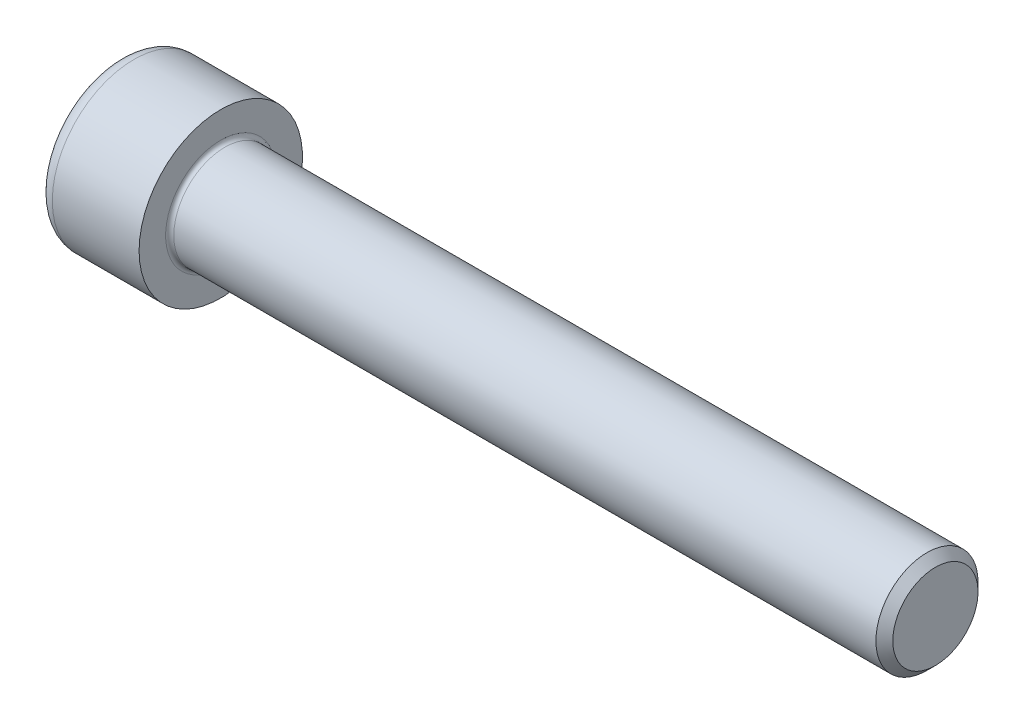
ISO-10303-21;
HEADER;
FILE_DESCRIPTION(('STEP AP214'),'2;1');
FILE_NAME('part.step','',(''),(''),'','','');
FILE_SCHEMA(('AUTOMOTIVE_DESIGN { 1 0 10303 214 1 1 1 1 }'));
ENDSEC;
DATA;
#1=APPLICATION_CONTEXT('core data for automotive mechanical design processes');
#2=APPLICATION_PROTOCOL_DEFINITION('international standard','automotive_design',2000,#1);
#3=PRODUCT_CONTEXT('',#1,'mechanical');
#4=PRODUCT('Part','Part','',(#3));
#5=PRODUCT_RELATED_PRODUCT_CATEGORY('part','',(#4));
#6=PRODUCT_DEFINITION_FORMATION('','',#4);
#7=PRODUCT_DEFINITION_CONTEXT('part definition',#1,'design');
#8=PRODUCT_DEFINITION('design','',#6,#7);
#9=PRODUCT_DEFINITION_SHAPE('','',#8);
#10=(LENGTH_UNIT() NAMED_UNIT(*) SI_UNIT(.MILLI.,.METRE.));
#11=(NAMED_UNIT(*) PLANE_ANGLE_UNIT() SI_UNIT($,.RADIAN.));
#12=(NAMED_UNIT(*) SI_UNIT($,.STERADIAN.) SOLID_ANGLE_UNIT());
#13=UNCERTAINTY_MEASURE_WITH_UNIT(LENGTH_MEASURE(1.E-05),#10,'distance_accuracy_value','');
#14=(GEOMETRIC_REPRESENTATION_CONTEXT(3) GLOBAL_UNCERTAINTY_ASSIGNED_CONTEXT((#13)) GLOBAL_UNIT_ASSIGNED_CONTEXT((#10,
#11,#12)) REPRESENTATION_CONTEXT('',''));
#15=CARTESIAN_POINT('',(0.,0.,0.));
#16=DIRECTION('',(0.,0.,1.));
#17=DIRECTION('',(1.,0.,0.));
#18=AXIS2_PLACEMENT_3D('',#15,#16,#17);
#19=CARTESIAN_POINT('',(0.,0.,0.));
#20=DIRECTION('',(-1.,0.,0.));
#21=DIRECTION('',(0.,0.,1.));
#22=AXIS2_PLACEMENT_3D('',#19,#20,#21);
#23=PLANE('',#22);
#24=DIRECTION('',(0.,-0.499999999999999,0.866025403784439));
#25=VECTOR('',#24,1.);
#26=CARTESIAN_POINT('',(0.,4.68519743447381,0.));
#27=LINE('',#26,#25);
#28=CARTESIAN_POINT('',(0.,4.68519743447381,0.));
#29=VERTEX_POINT('',#28);
#30=CARTESIAN_POINT('',(0.,2.34259871723691,4.05749999999999));
#31=VERTEX_POINT('',#30);
#32=EDGE_CURVE('E115',#29,#31,#27,.T.);
#33=ORIENTED_EDGE('',*,*,#32,.T.);
#34=DIRECTION('',(0.,1.,0.));
#35=VECTOR('',#34,1.);
#36=CARTESIAN_POINT('',(0.,-2.3425987172369,4.0575));
#37=LINE('',#36,#35);
#38=CARTESIAN_POINT('',(0.,-2.3425987172369,4.0575));
#39=VERTEX_POINT('',#38);
#40=EDGE_CURVE('E104',#39,#31,#37,.T.);
#41=ORIENTED_EDGE('',*,*,#40,.F.);
#42=DIRECTION('',(0.,-0.500000000000001,-0.866025403784438));
#43=VECTOR('',#42,1.);
#44=CARTESIAN_POINT('',(0.,-2.3425987172369,4.0575));
#45=LINE('',#44,#43);
#46=CARTESIAN_POINT('',(0.,-4.68519743447382,0.));
#47=VERTEX_POINT('',#46);
#48=EDGE_CURVE('E114',#39,#47,#45,.T.);
#49=ORIENTED_EDGE('',*,*,#48,.T.);
#50=DIRECTION('',(0.,0.499999999999999,-0.866025403784439));
#51=VECTOR('',#50,1.);
#52=CARTESIAN_POINT('',(0.,-4.68519743447382,0.));
#53=LINE('',#52,#51);
#54=CARTESIAN_POINT('',(0.,-2.34259871723692,-4.0575));
#55=VERTEX_POINT('',#54);
#56=EDGE_CURVE('E133',#47,#55,#53,.T.);
#57=ORIENTED_EDGE('',*,*,#56,.T.);
#58=DIRECTION('',(0.,-1.,0.));
#59=VECTOR('',#58,1.);
#60=CARTESIAN_POINT('',(0.,2.3425987172369,-4.05750000000001));
#61=LINE('',#60,#59);
#62=CARTESIAN_POINT('',(0.,2.3425987172369,-4.05750000000001));
#63=VERTEX_POINT('',#62);
#64=EDGE_CURVE('E136',#63,#55,#61,.T.);
#65=ORIENTED_EDGE('',*,*,#64,.F.);
#66=DIRECTION('',(0.,-0.500000000000001,-0.866025403784438));
#67=VECTOR('',#66,1.);
#68=CARTESIAN_POINT('',(0.,4.68519743447381,0.));
#69=LINE('',#68,#67);
#70=EDGE_CURVE('E129',#29,#63,#69,.T.);
#71=ORIENTED_EDGE('',*,*,#70,.F.);
#72=EDGE_LOOP('',(#33,#41,#49,#57,#65,#71));
#73=FACE_BOUND('',#72,.T.);
#74=CARTESIAN_POINT('',(0.,0.,0.));
#75=DIRECTION('',(-1.,0.,0.));
#76=DIRECTION('',(0.,0.,1.));
#77=AXIS2_PLACEMENT_3D('',#74,#75,#76);
#78=CIRCLE('',#77,6.5);
#79=CARTESIAN_POINT('',(0.,0.,6.5));
#80=VERTEX_POINT('',#79);
#81=EDGE_CURVE('E40',#80,#80,#78,.T.);
#82=ORIENTED_EDGE('',*,*,#81,.T.);
#83=EDGE_LOOP('',(#82));
#84=FACE_BOUND('',#83,.T.);
#85=ADVANCED_FACE('F33',(#73,#84),#23,.T.);
#86=CARTESIAN_POINT('',(-31.75,0.,0.));
#87=DIRECTION('',(-1.,0.,0.));
#88=DIRECTION('',(0.,0.,1.));
#89=AXIS2_PLACEMENT_3D('',#86,#87,#88);
#90=CYLINDRICAL_SURFACE('',#89,8.);
#91=CARTESIAN_POINT('',(1.5,0.,0.));
#92=DIRECTION('',(-1.,0.,0.));
#93=DIRECTION('',(0.,0.,1.));
#94=AXIS2_PLACEMENT_3D('',#91,#92,#93);
#95=CIRCLE('',#94,8.);
#96=CARTESIAN_POINT('',(1.5,0.,8.));
#97=VERTEX_POINT('',#96);
#98=EDGE_CURVE('E11',#97,#97,#95,.F.);
#99=ORIENTED_EDGE('',*,*,#98,.T.);
#100=EDGE_LOOP('',(#99));
#101=FACE_BOUND('',#100,.T.);
#102=CARTESIAN_POINT('',(10.,0.,0.));
#103=DIRECTION('',(-1.,0.,0.));
#104=DIRECTION('',(0.,0.,1.));
#105=AXIS2_PLACEMENT_3D('',#102,#103,#104);
#106=CIRCLE('',#105,8.);
#107=CARTESIAN_POINT('',(10.,0.,8.));
#108=VERTEX_POINT('',#107);
#109=EDGE_CURVE('E181',#108,#108,#106,.T.);
#110=ORIENTED_EDGE('',*,*,#109,.T.);
#111=EDGE_LOOP('',(#110));
#112=FACE_BOUND('',#111,.T.);
#113=ADVANCED_FACE('F208',(#101,#112),#90,.T.);
#114=CARTESIAN_POINT('',(10.,8.,0.));
#115=DIRECTION('',(1.,0.,0.));
#116=DIRECTION('',(0.,0.,-1.));
#117=AXIS2_PLACEMENT_3D('',#114,#115,#116);
#118=PLANE('',#117);
#119=CARTESIAN_POINT('',(10.,0.,0.));
#120=DIRECTION('',(1.,0.,0.));
#121=DIRECTION('',(0.,0.,-1.));
#122=AXIS2_PLACEMENT_3D('',#119,#120,#121);
#123=CIRCLE('',#122,5.39999999999998);
#124=CARTESIAN_POINT('',(10.,0.,-5.39999999999998));
#125=VERTEX_POINT('',#124);
#126=EDGE_CURVE('E184',#125,#125,#123,.F.);
#127=ORIENTED_EDGE('',*,*,#126,.T.);
#128=EDGE_LOOP('',(#127));
#129=FACE_BOUND('',#128,.T.);
#130=ORIENTED_EDGE('',*,*,#109,.F.);
#131=EDGE_LOOP('',(#130));
#132=FACE_BOUND('',#131,.T.);
#133=ADVANCED_FACE('F212',(#129,#132),#118,.T.);
#134=CARTESIAN_POINT('',(-31.75,0.,0.));
#135=DIRECTION('',(-1.,0.,0.));
#136=DIRECTION('',(0.,0.,1.));
#137=AXIS2_PLACEMENT_3D('',#134,#135,#136);
#138=CYLINDRICAL_SURFACE('',#137,4.99999999999998);
#139=CARTESIAN_POINT('',(10.4,0.,0.));
#140=DIRECTION('',(1.,0.,0.));
#141=DIRECTION('',(0.,0.,-1.));
#142=AXIS2_PLACEMENT_3D('',#139,#140,#141);
#143=CIRCLE('',#142,4.99999999999998);
#144=CARTESIAN_POINT('',(10.4,0.,-4.99999999999998));
#145=VERTEX_POINT('',#144);
#146=EDGE_CURVE('E187',#145,#145,#143,.T.);
#147=ORIENTED_EDGE('',*,*,#146,.T.);
#148=EDGE_LOOP('',(#147));
#149=FACE_BOUND('',#148,.T.);
#150=CARTESIAN_POINT('',(79.172,0.,0.));
#151=DIRECTION('',(-1.,0.,0.));
#152=DIRECTION('',(0.,0.,1.));
#153=AXIS2_PLACEMENT_3D('',#150,#151,#152);
#154=CIRCLE('',#153,4.99999999999997);
#155=CARTESIAN_POINT('',(79.172,0.,4.99999999999997));
#156=VERTEX_POINT('',#155);
#157=EDGE_CURVE('E178',#156,#156,#154,.T.);
#158=ORIENTED_EDGE('',*,*,#157,.T.);
#159=EDGE_LOOP('',(#158));
#160=FACE_BOUND('',#159,.T.);
#161=ADVANCED_FACE('F217',(#149,#160),#138,.T.);
#162=CARTESIAN_POINT('',(80.,0.,0.));
#163=DIRECTION('',(-1.,0.,0.));
#164=DIRECTION('',(0.,0.,1.));
#165=AXIS2_PLACEMENT_3D('',#162,#163,#164);
#166=CONICAL_SURFACE('',#165,4.172,0.785398163397422);
#167=ORIENTED_EDGE('',*,*,#157,.F.);
#168=EDGE_LOOP('',(#167));
#169=FACE_BOUND('',#168,.T.);
#170=CARTESIAN_POINT('',(80.,0.,0.));
#171=DIRECTION('',(-1.,0.,0.));
#172=DIRECTION('',(0.,0.,1.));
#173=AXIS2_PLACEMENT_3D('',#170,#171,#172);
#174=CIRCLE('',#173,4.172);
#175=CARTESIAN_POINT('',(80.,0.,4.172));
#176=VERTEX_POINT('',#175);
#177=EDGE_CURVE('E174',#176,#176,#174,.T.);
#178=ORIENTED_EDGE('',*,*,#177,.T.);
#179=EDGE_LOOP('',(#178));
#180=FACE_BOUND('',#179,.T.);
#181=ADVANCED_FACE('F224',(#169,#180),#166,.T.);
#182=CARTESIAN_POINT('',(80.,4.172,0.));
#183=DIRECTION('',(1.,0.,0.));
#184=DIRECTION('',(0.,0.,-1.));
#185=AXIS2_PLACEMENT_3D('',#182,#183,#184);
#186=PLANE('',#185);
#187=ORIENTED_EDGE('',*,*,#177,.F.);
#188=EDGE_LOOP('',(#187));
#189=FACE_BOUND('',#188,.T.);
#190=ADVANCED_FACE('F202',(#189),#186,.T.);
#191=CARTESIAN_POINT('',(10.4,0.,0.));
#192=DIRECTION('',(1.,0.,0.));
#193=DIRECTION('',(0.,0.,-1.));
#194=AXIS2_PLACEMENT_3D('',#191,#192,#193);
#195=TOROIDAL_SURFACE('',#194,5.39999999999998,0.4);
#196=ORIENTED_EDGE('',*,*,#146,.F.);
#197=EDGE_LOOP('',(#196));
#198=FACE_BOUND('',#197,.T.);
#199=ORIENTED_EDGE('',*,*,#126,.F.);
#200=EDGE_LOOP('',(#199));
#201=FACE_BOUND('',#200,.T.);
#202=ADVANCED_FACE('F194',(#198,#201),#195,.F.);
#203=CARTESIAN_POINT('',(1.5,0.,0.));
#204=DIRECTION('',(-1.,0.,0.));
#205=DIRECTION('',(0.,0.,1.));
#206=AXIS2_PLACEMENT_3D('',#203,#204,#205);
#207=TOROIDAL_SURFACE('',#206,6.5,1.5);
#208=ORIENTED_EDGE('',*,*,#98,.F.);
#209=EDGE_LOOP('',(#208));
#210=FACE_BOUND('',#209,.T.);
#211=ORIENTED_EDGE('',*,*,#81,.F.);
#212=EDGE_LOOP('',(#211));
#213=FACE_BOUND('',#212,.T.);
#214=ADVANCED_FACE('F192',(#210,#213),#207,.T.);
#215=CARTESIAN_POINT('',(5.,4.68519743447381,0.));
#216=DIRECTION('',(0.,-0.866025403784439,-0.499999999999999));
#217=DIRECTION('',(0.,0.499999999999999,-0.866025403784439));
#218=AXIS2_PLACEMENT_3D('',#215,#216,#217);
#219=PLANE('',#218);
#220=ORIENTED_EDGE('',*,*,#32,.F.);
#221=DIRECTION('',(-1.,0.,0.));
#222=VECTOR('',#221,1.);
#223=CARTESIAN_POINT('',(5.,4.68519743447381,0.));
#224=LINE('',#223,#222);
#225=CARTESIAN_POINT('',(5.,4.68519743447381,0.));
#226=VERTEX_POINT('',#225);
#227=EDGE_CURVE('E159',#226,#29,#224,.T.);
#228=ORIENTED_EDGE('',*,*,#227,.F.);
#229=DIRECTION('',(0.,-0.499999999999999,0.866025403784439));
#230=VECTOR('',#229,1.);
#231=CARTESIAN_POINT('',(5.,4.68519743447381,0.));
#232=LINE('',#231,#230);
#233=CARTESIAN_POINT('',(5.,3.51389807585536,2.02874999999999));
#234=VERTEX_POINT('',#233);
#235=EDGE_CURVE('E139',#226,#234,#232,.T.);
#236=ORIENTED_EDGE('',*,*,#235,.T.);
#237=CARTESIAN_POINT('',(5.,2.34259871723691,4.05749999999999));
#238=VERTEX_POINT('',#237);
#239=EDGE_CURVE('E123',#234,#238,#232,.T.);
#240=ORIENTED_EDGE('',*,*,#239,.T.);
#241=DIRECTION('',(-1.,0.,0.));
#242=VECTOR('',#241,1.);
#243=CARTESIAN_POINT('',(5.,2.34259871723691,4.05749999999999));
#244=LINE('',#243,#242);
#245=EDGE_CURVE('E108',#238,#31,#244,.T.);
#246=ORIENTED_EDGE('',*,*,#245,.T.);
#247=EDGE_LOOP('',(#220,#228,#236,#240,#246));
#248=FACE_BOUND('',#247,.T.);
#249=ADVANCED_FACE('F119',(#248),#219,.T.);
#250=CARTESIAN_POINT('',(5.,-2.3425987172369,4.0575));
#251=DIRECTION('',(0.,0.,1.));
#252=DIRECTION('',(0.,-1.,0.));
#253=AXIS2_PLACEMENT_3D('',#250,#251,#252);
#254=PLANE('',#253);
#255=ORIENTED_EDGE('',*,*,#40,.T.);
#256=ORIENTED_EDGE('',*,*,#245,.F.);
#257=DIRECTION('',(0.,1.,0.));
#258=VECTOR('',#257,1.);
#259=CARTESIAN_POINT('',(5.,-2.3425987172369,4.0575));
#260=LINE('',#259,#258);
#261=CARTESIAN_POINT('',(5.,0.,4.0575));
#262=VERTEX_POINT('',#261);
#263=EDGE_CURVE('E141',#262,#238,#260,.T.);
#264=ORIENTED_EDGE('',*,*,#263,.F.);
#265=CARTESIAN_POINT('',(5.,-2.3425987172369,4.0575));
#266=VERTEX_POINT('',#265);
#267=EDGE_CURVE('E142',#266,#262,#260,.T.);
#268=ORIENTED_EDGE('',*,*,#267,.F.);
#269=DIRECTION('',(-1.,0.,0.));
#270=VECTOR('',#269,1.);
#271=CARTESIAN_POINT('',(5.,-2.3425987172369,4.0575));
#272=LINE('',#271,#270);
#273=EDGE_CURVE('E110',#266,#39,#272,.T.);
#274=ORIENTED_EDGE('',*,*,#273,.T.);
#275=EDGE_LOOP('',(#255,#256,#264,#268,#274));
#276=FACE_BOUND('',#275,.T.);
#277=ADVANCED_FACE('F106',(#276),#254,.F.);
#278=CARTESIAN_POINT('',(5.,-2.3425987172369,4.0575));
#279=DIRECTION('',(0.,0.866025403784438,-0.500000000000001));
#280=DIRECTION('',(0.,0.500000000000001,0.866025403784438));
#281=AXIS2_PLACEMENT_3D('',#278,#279,#280);
#282=PLANE('',#281);
#283=ORIENTED_EDGE('',*,*,#48,.F.);
#284=ORIENTED_EDGE('',*,*,#273,.F.);
#285=DIRECTION('',(0.,-0.500000000000001,-0.866025403784438));
#286=VECTOR('',#285,1.);
#287=CARTESIAN_POINT('',(5.,-2.3425987172369,4.0575));
#288=LINE('',#287,#286);
#289=CARTESIAN_POINT('',(5.,-3.51389807585536,2.02875));
#290=VERTEX_POINT('',#289);
#291=EDGE_CURVE('E146',#266,#290,#288,.T.);
#292=ORIENTED_EDGE('',*,*,#291,.T.);
#293=CARTESIAN_POINT('',(5.,-4.68519743447382,0.));
#294=VERTEX_POINT('',#293);
#295=EDGE_CURVE('E145',#290,#294,#288,.T.);
#296=ORIENTED_EDGE('',*,*,#295,.T.);
#297=DIRECTION('',(-1.,0.,0.));
#298=VECTOR('',#297,1.);
#299=CARTESIAN_POINT('',(5.,-4.68519743447382,0.));
#300=LINE('',#299,#298);
#301=EDGE_CURVE('E167',#294,#47,#300,.T.);
#302=ORIENTED_EDGE('',*,*,#301,.T.);
#303=EDGE_LOOP('',(#283,#284,#292,#296,#302));
#304=FACE_BOUND('',#303,.T.);
#305=ADVANCED_FACE('F274',(#304),#282,.T.);
#306=CARTESIAN_POINT('',(5.,-4.68519743447382,0.));
#307=DIRECTION('',(0.,0.866025403784439,0.499999999999999));
#308=DIRECTION('',(0.,-0.499999999999999,0.866025403784439));
#309=AXIS2_PLACEMENT_3D('',#306,#307,#308);
#310=PLANE('',#309);
#311=ORIENTED_EDGE('',*,*,#56,.F.);
#312=ORIENTED_EDGE('',*,*,#301,.F.);
#313=DIRECTION('',(0.,0.499999999999999,-0.866025403784439));
#314=VECTOR('',#313,1.);
#315=CARTESIAN_POINT('',(5.,-4.68519743447382,0.));
#316=LINE('',#315,#314);
#317=CARTESIAN_POINT('',(5.,-3.51389807585537,-2.02875));
#318=VERTEX_POINT('',#317);
#319=EDGE_CURVE('E150',#294,#318,#316,.T.);
#320=ORIENTED_EDGE('',*,*,#319,.T.);
#321=CARTESIAN_POINT('',(5.,-2.34259871723692,-4.0575));
#322=VERTEX_POINT('',#321);
#323=EDGE_CURVE('E149',#318,#322,#316,.T.);
#324=ORIENTED_EDGE('',*,*,#323,.T.);
#325=DIRECTION('',(-1.,0.,0.));
#326=VECTOR('',#325,1.);
#327=CARTESIAN_POINT('',(5.,-2.34259871723692,-4.0575));
#328=LINE('',#327,#326);
#329=EDGE_CURVE('E164',#322,#55,#328,.T.);
#330=ORIENTED_EDGE('',*,*,#329,.T.);
#331=EDGE_LOOP('',(#311,#312,#320,#324,#330));
#332=FACE_BOUND('',#331,.T.);
#333=ADVANCED_FACE('F283',(#332),#310,.T.);
#334=CARTESIAN_POINT('',(5.,2.3425987172369,-4.05750000000001));
#335=DIRECTION('',(0.,0.,-1.));
#336=DIRECTION('',(0.,1.,0.));
#337=AXIS2_PLACEMENT_3D('',#334,#335,#336);
#338=PLANE('',#337);
#339=ORIENTED_EDGE('',*,*,#64,.T.);
#340=ORIENTED_EDGE('',*,*,#329,.F.);
#341=DIRECTION('',(0.,-1.,0.));
#342=VECTOR('',#341,1.);
#343=CARTESIAN_POINT('',(5.,2.3425987172369,-4.05750000000001));
#344=LINE('',#343,#342);
#345=CARTESIAN_POINT('',(5.,0.,-4.0575));
#346=VERTEX_POINT('',#345);
#347=EDGE_CURVE('E153',#346,#322,#344,.T.);
#348=ORIENTED_EDGE('',*,*,#347,.F.);
#349=CARTESIAN_POINT('',(5.,2.3425987172369,-4.05750000000001));
#350=VERTEX_POINT('',#349);
#351=EDGE_CURVE('E47',#350,#346,#344,.T.);
#352=ORIENTED_EDGE('',*,*,#351,.F.);
#353=DIRECTION('',(-1.,0.,0.));
#354=VECTOR('',#353,1.);
#355=CARTESIAN_POINT('',(5.,2.3425987172369,-4.05750000000001));
#356=LINE('',#355,#354);
#357=EDGE_CURVE('E161',#350,#63,#356,.T.);
#358=ORIENTED_EDGE('',*,*,#357,.T.);
#359=EDGE_LOOP('',(#339,#340,#348,#352,#358));
#360=FACE_BOUND('',#359,.T.);
#361=ADVANCED_FACE('F293',(#360),#338,.F.);
#362=CARTESIAN_POINT('',(5.,4.68519743447381,0.));
#363=DIRECTION('',(0.,0.866025403784438,-0.500000000000001));
#364=DIRECTION('',(0.,0.500000000000001,0.866025403784438));
#365=AXIS2_PLACEMENT_3D('',#362,#363,#364);
#366=PLANE('',#365);
#367=ORIENTED_EDGE('',*,*,#70,.T.);
#368=ORIENTED_EDGE('',*,*,#357,.F.);
#369=DIRECTION('',(0.,-0.500000000000001,-0.866025403784438));
#370=VECTOR('',#369,1.);
#371=CARTESIAN_POINT('',(5.,4.68519743447381,0.));
#372=LINE('',#371,#370);
#373=CARTESIAN_POINT('',(5.,3.51389807585536,-2.02875));
#374=VERTEX_POINT('',#373);
#375=EDGE_CURVE('E155',#374,#350,#372,.T.);
#376=ORIENTED_EDGE('',*,*,#375,.F.);
#377=EDGE_CURVE('E156',#226,#374,#372,.T.);
#378=ORIENTED_EDGE('',*,*,#377,.F.);
#379=ORIENTED_EDGE('',*,*,#227,.T.);
#380=EDGE_LOOP('',(#367,#368,#376,#378,#379));
#381=FACE_BOUND('',#380,.T.);
#382=ADVANCED_FACE('F303',(#381),#366,.F.);
#383=CARTESIAN_POINT('',(5.,4.68519743447381,0.));
#384=DIRECTION('',(1.,0.,0.));
#385=DIRECTION('',(0.,0.,-1.));
#386=AXIS2_PLACEMENT_3D('',#383,#384,#385);
#387=PLANE('',#386);
#388=ORIENTED_EDGE('',*,*,#347,.T.);
#389=ORIENTED_EDGE('',*,*,#323,.F.);
#390=CARTESIAN_POINT('',(5.,0.,0.));
#391=DIRECTION('',(-1.,0.,0.));
#392=DIRECTION('',(0.,0.,1.));
#393=AXIS2_PLACEMENT_3D('',#390,#391,#392);
#394=CIRCLE('',#393,4.0575);
#395=EDGE_CURVE('E389',#346,#318,#394,.T.);
#396=ORIENTED_EDGE('',*,*,#395,.F.);
#397=EDGE_LOOP('',(#388,#389,#396));
#398=FACE_BOUND('',#397,.T.);
#399=ADVANCED_FACE('F313',(#398),#387,.F.);
#400=ORIENTED_EDGE('',*,*,#319,.F.);
#401=ORIENTED_EDGE('',*,*,#295,.F.);
#402=EDGE_CURVE('E387',#318,#290,#394,.T.);
#403=ORIENTED_EDGE('',*,*,#402,.F.);
#404=EDGE_LOOP('',(#400,#401,#403));
#405=FACE_BOUND('',#404,.T.);
#406=ADVANCED_FACE('F323',(#405),#387,.F.);
#407=ORIENTED_EDGE('',*,*,#291,.F.);
#408=ORIENTED_EDGE('',*,*,#267,.T.);
#409=EDGE_CURVE('E124',#290,#262,#394,.T.);
#410=ORIENTED_EDGE('',*,*,#409,.F.);
#411=EDGE_LOOP('',(#407,#408,#410));
#412=FACE_BOUND('',#411,.T.);
#413=ADVANCED_FACE('F334',(#412),#387,.F.);
#414=ORIENTED_EDGE('',*,*,#263,.T.);
#415=ORIENTED_EDGE('',*,*,#239,.F.);
#416=EDGE_CURVE('E171',#262,#234,#394,.T.);
#417=ORIENTED_EDGE('',*,*,#416,.F.);
#418=EDGE_LOOP('',(#414,#415,#417));
#419=FACE_BOUND('',#418,.T.);
#420=ADVANCED_FACE('F343',(#419),#387,.F.);
#421=ORIENTED_EDGE('',*,*,#235,.F.);
#422=ORIENTED_EDGE('',*,*,#377,.T.);
#423=EDGE_CURVE('E175',#234,#374,#394,.T.);
#424=ORIENTED_EDGE('',*,*,#423,.F.);
#425=EDGE_LOOP('',(#421,#422,#424));
#426=FACE_BOUND('',#425,.T.);
#427=ADVANCED_FACE('F352',(#426),#387,.F.);
#428=ORIENTED_EDGE('',*,*,#375,.T.);
#429=ORIENTED_EDGE('',*,*,#351,.T.);
#430=EDGE_CURVE('E392',#374,#346,#394,.T.);
#431=ORIENTED_EDGE('',*,*,#430,.F.);
#432=EDGE_LOOP('',(#428,#429,#431));
#433=FACE_BOUND('',#432,.T.);
#434=ADVANCED_FACE('F326',(#433),#387,.F.);
#435=CARTESIAN_POINT('',(5.,0.,0.));
#436=DIRECTION('',(-1.,0.,0.));
#437=DIRECTION('',(0.,0.,1.));
#438=AXIS2_PLACEMENT_3D('',#435,#436,#437);
#439=CONICAL_SURFACE('',#438,4.0575,1.04719755119659);
#440=CARTESIAN_POINT('',(7.34259871723693,0.,0.));
#441=VERTEX_POINT('',#440);
#442=VERTEX_LOOP('',#441);
#443=FACE_BOUND('',#442,.T.);
#444=ORIENTED_EDGE('',*,*,#416,.T.);
#445=ORIENTED_EDGE('',*,*,#423,.T.);
#446=ORIENTED_EDGE('',*,*,#430,.T.);
#447=ORIENTED_EDGE('',*,*,#395,.T.);
#448=ORIENTED_EDGE('',*,*,#402,.T.);
#449=ORIENTED_EDGE('',*,*,#409,.T.);
#450=EDGE_LOOP('',(#444,#445,#446,#447,#448,#449));
#451=FACE_BOUND('',#450,.T.);
#452=ADVANCED_FACE('F369',(#443,#451),#439,.F.);
#453=CLOSED_SHELL('',(#85,#113,#133,#161,#181,#190,#202,#214,#249,#277,#305,#333,#361,#382,#399,
#406,#413,#420,#427,#434,#452));
#454=MANIFOLD_SOLID_BREP('B2',#453);
#455=ADVANCED_BREP_SHAPE_REPRESENTATION('',(#18,#454),#14);
#456=SHAPE_DEFINITION_REPRESENTATION(#9,#455);
ENDSEC;
END-ISO-10303-21;
